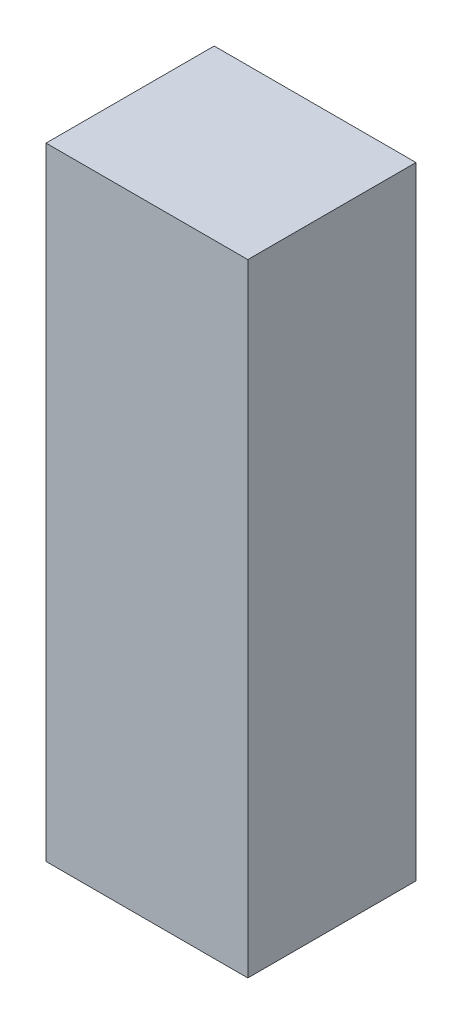
ISO-10303-21;
HEADER;
FILE_DESCRIPTION(('STEP AP214'),'2;1');
FILE_NAME('part.step','',(''),(''),'','','');
FILE_SCHEMA(('AUTOMOTIVE_DESIGN { 1 0 10303 214 1 1 1 1 }'));
ENDSEC;
DATA;
#1=APPLICATION_CONTEXT('core data for automotive mechanical design processes');
#2=APPLICATION_PROTOCOL_DEFINITION('international standard','automotive_design',2000,#1);
#3=PRODUCT_CONTEXT('',#1,'mechanical');
#4=PRODUCT('Part','Part','',(#3));
#5=PRODUCT_RELATED_PRODUCT_CATEGORY('part','',(#4));
#6=PRODUCT_DEFINITION_FORMATION('','',#4);
#7=PRODUCT_DEFINITION_CONTEXT('part definition',#1,'design');
#8=PRODUCT_DEFINITION('design','',#6,#7);
#9=PRODUCT_DEFINITION_SHAPE('','',#8);
#10=(LENGTH_UNIT() NAMED_UNIT(*) SI_UNIT(.MILLI.,.METRE.));
#11=(NAMED_UNIT(*) PLANE_ANGLE_UNIT() SI_UNIT($,.RADIAN.));
#12=(NAMED_UNIT(*) SI_UNIT($,.STERADIAN.) SOLID_ANGLE_UNIT());
#13=UNCERTAINTY_MEASURE_WITH_UNIT(LENGTH_MEASURE(1.E-05),#10,'distance_accuracy_value','');
#14=(GEOMETRIC_REPRESENTATION_CONTEXT(3) GLOBAL_UNCERTAINTY_ASSIGNED_CONTEXT((#13)) GLOBAL_UNIT_ASSIGNED_CONTEXT((#10,
#11,#12)) REPRESENTATION_CONTEXT('',''));
#15=CARTESIAN_POINT('',(0.,0.,0.));
#16=DIRECTION('',(0.,0.,1.));
#17=DIRECTION('',(1.,0.,0.));
#18=AXIS2_PLACEMENT_3D('',#15,#16,#17);
#19=CARTESIAN_POINT('',(-0.36,-0.485,0.));
#20=DIRECTION('',(1.,0.,0.));
#21=DIRECTION('',(0.,0.,1.));
#22=AXIS2_PLACEMENT_3D('',#19,#20,#21);
#23=PLANE('',#22);
#24=DIRECTION('',(0.,1.,0.));
#25=VECTOR('',#24,1.);
#26=CARTESIAN_POINT('',(-0.36,-0.485,0.1));
#27=LINE('',#26,#25);
#28=CARTESIAN_POINT('',(-0.36,-0.485,0.1));
#29=VERTEX_POINT('',#28);
#30=CARTESIAN_POINT('',(-0.36,-0.115,0.1));
#31=VERTEX_POINT('',#30);
#32=EDGE_CURVE('E11',#29,#31,#27,.T.);
#33=ORIENTED_EDGE('',*,*,#32,.T.);
#34=DIRECTION('',(0.,0.,1.));
#35=VECTOR('',#34,1.);
#36=CARTESIAN_POINT('',(-0.36,-0.115,0.));
#37=LINE('',#36,#35);
#38=CARTESIAN_POINT('',(-0.36,-0.115,0.));
#39=VERTEX_POINT('',#38);
#40=EDGE_CURVE('E24',#39,#31,#37,.T.);
#41=ORIENTED_EDGE('',*,*,#40,.F.);
#42=DIRECTION('',(0.,1.,0.));
#43=VECTOR('',#42,1.);
#44=CARTESIAN_POINT('',(-0.36,-0.485,0.));
#45=LINE('',#44,#43);
#46=CARTESIAN_POINT('',(-0.36,-0.485,0.));
#47=VERTEX_POINT('',#46);
#48=EDGE_CURVE('E86',#47,#39,#45,.T.);
#49=ORIENTED_EDGE('',*,*,#48,.F.);
#50=DIRECTION('',(0.,0.,1.));
#51=VECTOR('',#50,1.);
#52=CARTESIAN_POINT('',(-0.36,-0.485,0.));
#53=LINE('',#52,#51);
#54=EDGE_CURVE('E36',#47,#29,#53,.T.);
#55=ORIENTED_EDGE('',*,*,#54,.T.);
#56=EDGE_LOOP('',(#33,#41,#49,#55));
#57=FACE_BOUND('',#56,.T.);
#58=ADVANCED_FACE('F17',(#57),#23,.F.);
#59=CARTESIAN_POINT('',(-0.24,-0.485,0.));
#60=DIRECTION('',(1.,0.,0.));
#61=DIRECTION('',(0.,0.,1.));
#62=AXIS2_PLACEMENT_3D('',#59,#60,#61);
#63=PLANE('',#62);
#64=DIRECTION('',(0.,0.,1.));
#65=VECTOR('',#64,1.);
#66=CARTESIAN_POINT('',(-0.24,-0.485,0.));
#67=LINE('',#66,#65);
#68=CARTESIAN_POINT('',(-0.24,-0.485,0.));
#69=VERTEX_POINT('',#68);
#70=CARTESIAN_POINT('',(-0.24,-0.485,0.1));
#71=VERTEX_POINT('',#70);
#72=EDGE_CURVE('E83',#69,#71,#67,.T.);
#73=ORIENTED_EDGE('',*,*,#72,.F.);
#74=DIRECTION('',(0.,1.,0.));
#75=VECTOR('',#74,1.);
#76=CARTESIAN_POINT('',(-0.24,-0.485,0.));
#77=LINE('',#76,#75);
#78=CARTESIAN_POINT('',(-0.24,-0.115,0.));
#79=VERTEX_POINT('',#78);
#80=EDGE_CURVE('E63',#69,#79,#77,.T.);
#81=ORIENTED_EDGE('',*,*,#80,.T.);
#82=DIRECTION('',(0.,0.,1.));
#83=VECTOR('',#82,1.);
#84=CARTESIAN_POINT('',(-0.24,-0.115,0.));
#85=LINE('',#84,#83);
#86=CARTESIAN_POINT('',(-0.24,-0.115,0.1));
#87=VERTEX_POINT('',#86);
#88=EDGE_CURVE('E57',#79,#87,#85,.T.);
#89=ORIENTED_EDGE('',*,*,#88,.T.);
#90=DIRECTION('',(0.,1.,0.));
#91=VECTOR('',#90,1.);
#92=CARTESIAN_POINT('',(-0.24,-0.485,0.1));
#93=LINE('',#92,#91);
#94=EDGE_CURVE('E60',#71,#87,#93,.T.);
#95=ORIENTED_EDGE('',*,*,#94,.F.);
#96=EDGE_LOOP('',(#73,#81,#89,#95));
#97=FACE_BOUND('',#96,.T.);
#98=ADVANCED_FACE('F59',(#97),#63,.T.);
#99=CARTESIAN_POINT('',(-0.36,-0.485,0.));
#100=DIRECTION('',(0.,1.,0.));
#101=DIRECTION('',(0.,0.,1.));
#102=AXIS2_PLACEMENT_3D('',#99,#100,#101);
#103=PLANE('',#102);
#104=ORIENTED_EDGE('',*,*,#72,.T.);
#105=DIRECTION('',(1.,0.,0.));
#106=VECTOR('',#105,1.);
#107=CARTESIAN_POINT('',(-0.36,-0.485,0.1));
#108=LINE('',#107,#106);
#109=EDGE_CURVE('E71',#29,#71,#108,.T.);
#110=ORIENTED_EDGE('',*,*,#109,.F.);
#111=ORIENTED_EDGE('',*,*,#54,.F.);
#112=DIRECTION('',(1.,0.,0.));
#113=VECTOR('',#112,1.);
#114=CARTESIAN_POINT('',(-0.36,-0.485,0.));
#115=LINE('',#114,#113);
#116=EDGE_CURVE('E76',#47,#69,#115,.T.);
#117=ORIENTED_EDGE('',*,*,#116,.T.);
#118=EDGE_LOOP('',(#104,#110,#111,#117));
#119=FACE_BOUND('',#118,.T.);
#120=ADVANCED_FACE('F91',(#119),#103,.F.);
#121=CARTESIAN_POINT('',(-0.36,-0.115,0.));
#122=DIRECTION('',(0.,1.,0.));
#123=DIRECTION('',(0.,0.,1.));
#124=AXIS2_PLACEMENT_3D('',#121,#122,#123);
#125=PLANE('',#124);
#126=DIRECTION('',(1.,0.,0.));
#127=VECTOR('',#126,1.);
#128=CARTESIAN_POINT('',(-0.36,-0.115,0.));
#129=LINE('',#128,#127);
#130=EDGE_CURVE('E74',#39,#79,#129,.T.);
#131=ORIENTED_EDGE('',*,*,#130,.F.);
#132=ORIENTED_EDGE('',*,*,#40,.T.);
#133=DIRECTION('',(1.,0.,0.));
#134=VECTOR('',#133,1.);
#135=CARTESIAN_POINT('',(-0.36,-0.115,0.1));
#136=LINE('',#135,#134);
#137=EDGE_CURVE('E69',#31,#87,#136,.T.);
#138=ORIENTED_EDGE('',*,*,#137,.T.);
#139=ORIENTED_EDGE('',*,*,#88,.F.);
#140=EDGE_LOOP('',(#131,#132,#138,#139));
#141=FACE_BOUND('',#140,.T.);
#142=ADVANCED_FACE('F73',(#141),#125,.T.);
#143=CARTESIAN_POINT('',(-0.36,-0.485,0.));
#144=DIRECTION('',(0.,0.,1.));
#145=DIRECTION('',(1.,0.,0.));
#146=AXIS2_PLACEMENT_3D('',#143,#144,#145);
#147=PLANE('',#146);
#148=ORIENTED_EDGE('',*,*,#130,.T.);
#149=ORIENTED_EDGE('',*,*,#80,.F.);
#150=ORIENTED_EDGE('',*,*,#116,.F.);
#151=ORIENTED_EDGE('',*,*,#48,.T.);
#152=EDGE_LOOP('',(#148,#149,#150,#151));
#153=FACE_BOUND('',#152,.T.);
#154=ADVANCED_FACE('F89',(#153),#147,.F.);
#155=CARTESIAN_POINT('',(-0.36,-0.485,0.1));
#156=DIRECTION('',(0.,0.,1.));
#157=DIRECTION('',(1.,0.,0.));
#158=AXIS2_PLACEMENT_3D('',#155,#156,#157);
#159=PLANE('',#158);
#160=ORIENTED_EDGE('',*,*,#32,.F.);
#161=ORIENTED_EDGE('',*,*,#109,.T.);
#162=ORIENTED_EDGE('',*,*,#94,.T.);
#163=ORIENTED_EDGE('',*,*,#137,.F.);
#164=EDGE_LOOP('',(#160,#161,#162,#163));
#165=FACE_BOUND('',#164,.T.);
#166=ADVANCED_FACE('F68',(#165),#159,.T.);
#167=CLOSED_SHELL('',(#58,#98,#120,#142,#154,#166));
#168=MANIFOLD_SOLID_BREP('B1',#167);
#169=ADVANCED_BREP_SHAPE_REPRESENTATION('',(#18,#168),#14);
#170=SHAPE_DEFINITION_REPRESENTATION(#9,#169);
ENDSEC;
END-ISO-10303-21;
